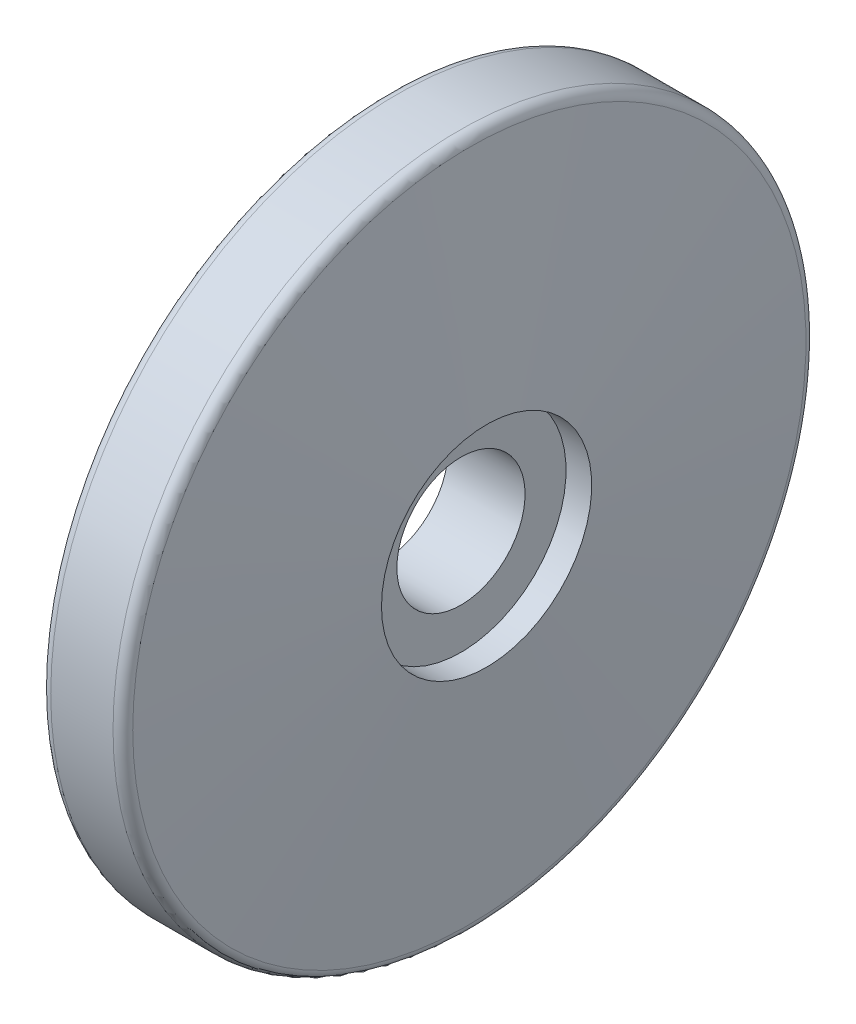
ISO-10303-21;
HEADER;
FILE_DESCRIPTION(('STEP AP214'),'2;1');
FILE_NAME('part.step','',(''),(''),'','','');
FILE_SCHEMA(('AUTOMOTIVE_DESIGN { 1 0 10303 214 1 1 1 1 }'));
ENDSEC;
DATA;
#1=APPLICATION_CONTEXT('core data for automotive mechanical design processes');
#2=APPLICATION_PROTOCOL_DEFINITION('international standard','automotive_design',2000,#1);
#3=PRODUCT_CONTEXT('',#1,'mechanical');
#4=PRODUCT('Part','Part','',(#3));
#5=PRODUCT_RELATED_PRODUCT_CATEGORY('part','',(#4));
#6=PRODUCT_DEFINITION_FORMATION('','',#4);
#7=PRODUCT_DEFINITION_CONTEXT('part definition',#1,'design');
#8=PRODUCT_DEFINITION('design','',#6,#7);
#9=PRODUCT_DEFINITION_SHAPE('','',#8);
#10=(LENGTH_UNIT() NAMED_UNIT(*) SI_UNIT(.MILLI.,.METRE.));
#11=(NAMED_UNIT(*) PLANE_ANGLE_UNIT() SI_UNIT($,.RADIAN.));
#12=(NAMED_UNIT(*) SI_UNIT($,.STERADIAN.) SOLID_ANGLE_UNIT());
#13=UNCERTAINTY_MEASURE_WITH_UNIT(LENGTH_MEASURE(1.E-05),#10,'distance_accuracy_value','');
#14=(GEOMETRIC_REPRESENTATION_CONTEXT(3) GLOBAL_UNCERTAINTY_ASSIGNED_CONTEXT((#13)) GLOBAL_UNIT_ASSIGNED_CONTEXT((#10,
#11,#12)) REPRESENTATION_CONTEXT('',''));
#15=CARTESIAN_POINT('',(0.,0.,0.));
#16=DIRECTION('',(0.,0.,1.));
#17=DIRECTION('',(1.,0.,0.));
#18=AXIS2_PLACEMENT_3D('',#15,#16,#17);
#19=CARTESIAN_POINT('',(6.42830082929983,20.5,0.));
#20=DIRECTION('',(-1.,0.,0.));
#21=DIRECTION('',(0.,0.,1.));
#22=AXIS2_PLACEMENT_3D('',#19,#20,#21);
#23=PLANE('',#22);
#24=CARTESIAN_POINT('',(6.42830082929979,0.,0.));
#25=DIRECTION('',(-1.,0.,0.));
#26=DIRECTION('',(0.,0.,1.));
#27=AXIS2_PLACEMENT_3D('',#24,#25,#26);
#28=CIRCLE('',#27,20.5);
#29=CARTESIAN_POINT('',(6.42830082929979,0.,20.5));
#30=VERTEX_POINT('',#29);
#31=EDGE_CURVE('E72',#30,#30,#28,.T.);
#32=ORIENTED_EDGE('',*,*,#31,.F.);
#33=EDGE_LOOP('',(#32));
#34=FACE_BOUND('',#33,.T.);
#35=CARTESIAN_POINT('',(6.42830082929979,0.,0.));
#36=DIRECTION('',(-1.,0.,0.));
#37=DIRECTION('',(0.,0.,1.));
#38=AXIS2_PLACEMENT_3D('',#35,#36,#37);
#39=CIRCLE('',#38,12.5);
#40=CARTESIAN_POINT('',(6.42830082929979,0.,12.5));
#41=VERTEX_POINT('',#40);
#42=EDGE_CURVE('E10',#41,#41,#39,.T.);
#43=ORIENTED_EDGE('',*,*,#42,.T.);
#44=EDGE_LOOP('',(#43));
#45=FACE_BOUND('',#44,.T.);
#46=ADVANCED_FACE('F32',(#34,#45),#23,.F.);
#47=CARTESIAN_POINT('',(-643.332684127967,0.,0.));
#48=DIRECTION('',(-1.,0.,0.));
#49=DIRECTION('',(0.,0.,1.));
#50=AXIS2_PLACEMENT_3D('',#47,#48,#49);
#51=CYLINDRICAL_SURFACE('',#50,12.5);
#52=ORIENTED_EDGE('',*,*,#42,.F.);
#53=EDGE_LOOP('',(#52));
#54=FACE_BOUND('',#53,.T.);
#55=CARTESIAN_POINT('',(-8.57169917070022,0.,0.));
#56=DIRECTION('',(-1.,0.,0.));
#57=DIRECTION('',(0.,0.,1.));
#58=AXIS2_PLACEMENT_3D('',#55,#56,#57);
#59=CIRCLE('',#58,12.5);
#60=CARTESIAN_POINT('',(-8.57169917070022,0.,12.5));
#61=VERTEX_POINT('',#60);
#62=EDGE_CURVE('E38',#61,#61,#59,.T.);
#63=ORIENTED_EDGE('',*,*,#62,.T.);
#64=EDGE_LOOP('',(#63));
#65=FACE_BOUND('',#64,.T.);
#66=ADVANCED_FACE('F79',(#54,#65),#51,.F.);
#67=CARTESIAN_POINT('',(-8.57169917070017,12.5,0.));
#68=DIRECTION('',(1.,0.,0.));
#69=DIRECTION('',(0.,0.,-1.));
#70=AXIS2_PLACEMENT_3D('',#67,#68,#69);
#71=PLANE('',#70);
#72=ORIENTED_EDGE('',*,*,#62,.F.);
#73=EDGE_LOOP('',(#72));
#74=FACE_BOUND('',#73,.T.);
#75=CARTESIAN_POINT('',(-8.57169917070022,0.,0.));
#76=DIRECTION('',(-1.,0.,0.));
#77=DIRECTION('',(0.,0.,1.));
#78=AXIS2_PLACEMENT_3D('',#75,#76,#77);
#79=CIRCLE('',#78,26.);
#80=CARTESIAN_POINT('',(-8.57169917070022,0.,26.));
#81=VERTEX_POINT('',#80);
#82=EDGE_CURVE('E42',#81,#81,#79,.T.);
#83=ORIENTED_EDGE('',*,*,#82,.T.);
#84=EDGE_LOOP('',(#83));
#85=FACE_BOUND('',#84,.T.);
#86=ADVANCED_FACE('F83',(#74,#85),#71,.F.);
#87=CARTESIAN_POINT('',(-643.332684127967,0.,0.));
#88=DIRECTION('',(-1.,0.,0.));
#89=DIRECTION('',(0.,0.,1.));
#90=AXIS2_PLACEMENT_3D('',#87,#88,#89);
#91=CYLINDRICAL_SURFACE('',#90,26.);
#92=ORIENTED_EDGE('',*,*,#82,.F.);
#93=EDGE_LOOP('',(#92));
#94=FACE_BOUND('',#93,.T.);
#95=CARTESIAN_POINT('',(-13.0716991707002,0.,0.));
#96=DIRECTION('',(-1.,0.,0.));
#97=DIRECTION('',(0.,0.,1.));
#98=AXIS2_PLACEMENT_3D('',#95,#96,#97);
#99=CIRCLE('',#98,26.);
#100=CARTESIAN_POINT('',(-13.0716991707002,0.,26.));
#101=VERTEX_POINT('',#100);
#102=EDGE_CURVE('E46',#101,#101,#99,.T.);
#103=ORIENTED_EDGE('',*,*,#102,.T.);
#104=EDGE_LOOP('',(#103));
#105=FACE_BOUND('',#104,.T.);
#106=ADVANCED_FACE('F88',(#94,#105),#91,.F.);
#107=CARTESIAN_POINT('',(-13.0716991707002,26.,0.));
#108=DIRECTION('',(1.,0.,0.));
#109=DIRECTION('',(0.,0.,-1.));
#110=AXIS2_PLACEMENT_3D('',#107,#108,#109);
#111=PLANE('',#110);
#112=ORIENTED_EDGE('',*,*,#102,.F.);
#113=EDGE_LOOP('',(#112));
#114=FACE_BOUND('',#113,.T.);
#115=CARTESIAN_POINT('',(-13.0716991707002,0.,0.));
#116=DIRECTION('',(-1.,0.,0.));
#117=DIRECTION('',(0.,0.,1.));
#118=AXIS2_PLACEMENT_3D('',#115,#116,#117);
#119=CIRCLE('',#118,30.);
#120=CARTESIAN_POINT('',(-13.0716991707002,0.,30.));
#121=VERTEX_POINT('',#120);
#122=EDGE_CURVE('E51',#121,#121,#119,.T.);
#123=ORIENTED_EDGE('',*,*,#122,.T.);
#124=EDGE_LOOP('',(#123));
#125=FACE_BOUND('',#124,.T.);
#126=ADVANCED_FACE('F94',(#114,#125),#111,.F.);
#127=CARTESIAN_POINT('',(-643.332684127967,0.,0.));
#128=DIRECTION('',(-1.,0.,0.));
#129=DIRECTION('',(0.,0.,1.));
#130=AXIS2_PLACEMENT_3D('',#127,#128,#129);
#131=CYLINDRICAL_SURFACE('',#130,30.);
#132=ORIENTED_EDGE('',*,*,#122,.F.);
#133=EDGE_LOOP('',(#132));
#134=FACE_BOUND('',#133,.T.);
#135=CARTESIAN_POINT('',(-8.07169917070016,0.,0.));
#136=DIRECTION('',(-1.,0.,0.));
#137=DIRECTION('',(0.,0.,1.));
#138=AXIS2_PLACEMENT_3D('',#135,#136,#137);
#139=CIRCLE('',#138,30.);
#140=CARTESIAN_POINT('',(-8.07169917070016,0.,30.));
#141=VERTEX_POINT('',#140);
#142=EDGE_CURVE('E54',#141,#141,#139,.T.);
#143=ORIENTED_EDGE('',*,*,#142,.T.);
#144=EDGE_LOOP('',(#143));
#145=FACE_BOUND('',#144,.T.);
#146=ADVANCED_FACE('F98',(#134,#145),#131,.T.);
#147=CARTESIAN_POINT('',(-8.07169917070017,30.,0.));
#148=DIRECTION('',(1.,0.,0.));
#149=DIRECTION('',(0.,0.,-1.));
#150=AXIS2_PLACEMENT_3D('',#147,#148,#149);
#151=PLANE('',#150);
#152=ORIENTED_EDGE('',*,*,#142,.F.);
#153=EDGE_LOOP('',(#152));
#154=FACE_BOUND('',#153,.T.);
#155=CARTESIAN_POINT('',(-8.07169917070016,0.,0.));
#156=DIRECTION('',(-1.,0.,0.));
#157=DIRECTION('',(0.,0.,1.));
#158=AXIS2_PLACEMENT_3D('',#155,#156,#157);
#159=CIRCLE('',#158,65.5);
#160=CARTESIAN_POINT('',(-8.07169917070016,0.,65.5));
#161=VERTEX_POINT('',#160);
#162=EDGE_CURVE('E57',#161,#161,#159,.T.);
#163=ORIENTED_EDGE('',*,*,#162,.T.);
#164=EDGE_LOOP('',(#163));
#165=FACE_BOUND('',#164,.T.);
#166=ADVANCED_FACE('F102',(#154,#165),#151,.F.);
#167=CARTESIAN_POINT('',(-6.07169917070017,0.,0.));
#168=DIRECTION('',(-1.,0.,0.));
#169=DIRECTION('',(0.,0.,1.));
#170=AXIS2_PLACEMENT_3D('',#167,#168,#169);
#171=TOROIDAL_SURFACE('',#170,65.5,2.);
#172=ORIENTED_EDGE('',*,*,#162,.F.);
#173=EDGE_LOOP('',(#172));
#174=FACE_BOUND('',#173,.T.);
#175=CARTESIAN_POINT('',(-6.07169917070016,0.,0.));
#176=DIRECTION('',(-1.,0.,0.));
#177=DIRECTION('',(0.,0.,1.));
#178=AXIS2_PLACEMENT_3D('',#175,#176,#177);
#179=CIRCLE('',#178,67.5);
#180=CARTESIAN_POINT('',(-6.07169917070016,0.,67.5));
#181=VERTEX_POINT('',#180);
#182=EDGE_CURVE('E60',#181,#181,#179,.T.);
#183=ORIENTED_EDGE('',*,*,#182,.T.);
#184=EDGE_LOOP('',(#183));
#185=FACE_BOUND('',#184,.T.);
#186=ADVANCED_FACE('F106',(#174,#185),#171,.T.);
#187=CARTESIAN_POINT('',(-643.332684127967,0.,0.));
#188=DIRECTION('',(-1.,0.,0.));
#189=DIRECTION('',(0.,0.,1.));
#190=AXIS2_PLACEMENT_3D('',#187,#188,#189);
#191=CYLINDRICAL_SURFACE('',#190,67.5);
#192=ORIENTED_EDGE('',*,*,#182,.F.);
#193=EDGE_LOOP('',(#192));
#194=FACE_BOUND('',#193,.T.);
#195=CARTESIAN_POINT('',(6.07169917070016,0.,0.));
#196=DIRECTION('',(-1.,0.,0.));
#197=DIRECTION('',(0.,0.,1.));
#198=AXIS2_PLACEMENT_3D('',#195,#196,#197);
#199=CIRCLE('',#198,67.5);
#200=CARTESIAN_POINT('',(6.07169917070016,0.,67.5));
#201=VERTEX_POINT('',#200);
#202=EDGE_CURVE('E63',#201,#201,#199,.T.);
#203=ORIENTED_EDGE('',*,*,#202,.T.);
#204=EDGE_LOOP('',(#203));
#205=FACE_BOUND('',#204,.T.);
#206=ADVANCED_FACE('F110',(#194,#205),#191,.T.);
#207=CARTESIAN_POINT('',(6.07169917070017,0.,0.));
#208=DIRECTION('',(-1.,0.,0.));
#209=DIRECTION('',(0.,0.,1.));
#210=AXIS2_PLACEMENT_3D('',#207,#208,#209);
#211=TOROIDAL_SURFACE('',#210,65.5,2.);
#212=ORIENTED_EDGE('',*,*,#202,.F.);
#213=EDGE_LOOP('',(#212));
#214=FACE_BOUND('',#213,.T.);
#215=CARTESIAN_POINT('',(8.0661766333211,0.,0.));
#216=DIRECTION('',(-1.,0.,0.));
#217=DIRECTION('',(0.,0.,1.));
#218=AXIS2_PLACEMENT_3D('',#215,#216,#217);
#219=CIRCLE('',#218,65.6485249174292);
#220=CARTESIAN_POINT('',(8.0661766333211,0.,65.6485249174292));
#221=VERTEX_POINT('',#220);
#222=EDGE_CURVE('E66',#221,#221,#219,.T.);
#223=ORIENTED_EDGE('',*,*,#222,.T.);
#224=EDGE_LOOP('',(#223));
#225=FACE_BOUND('',#224,.T.);
#226=ADVANCED_FACE('F114',(#214,#225),#211,.T.);
#227=CARTESIAN_POINT('',(11.4283008292998,0.,0.));
#228=DIRECTION('',(-1.,0.,0.));
#229=DIRECTION('',(0.,0.,1.));
#230=AXIS2_PLACEMENT_3D('',#227,#228,#229);
#231=CONICAL_SURFACE('',#230,20.5,1.49646543962723);
#232=ORIENTED_EDGE('',*,*,#222,.F.);
#233=EDGE_LOOP('',(#232));
#234=FACE_BOUND('',#233,.T.);
#235=CARTESIAN_POINT('',(11.4283008292998,0.,0.));
#236=DIRECTION('',(-1.,0.,0.));
#237=DIRECTION('',(0.,0.,1.));
#238=AXIS2_PLACEMENT_3D('',#235,#236,#237);
#239=CIRCLE('',#238,20.5);
#240=CARTESIAN_POINT('',(11.4283008292998,0.,20.5));
#241=VERTEX_POINT('',#240);
#242=EDGE_CURVE('E69',#241,#241,#239,.T.);
#243=ORIENTED_EDGE('',*,*,#242,.T.);
#244=EDGE_LOOP('',(#243));
#245=FACE_BOUND('',#244,.T.);
#246=ADVANCED_FACE('F118',(#234,#245),#231,.T.);
#247=CARTESIAN_POINT('',(-643.332684127967,0.,0.));
#248=DIRECTION('',(-1.,0.,0.));
#249=DIRECTION('',(0.,0.,1.));
#250=AXIS2_PLACEMENT_3D('',#247,#248,#249);
#251=CYLINDRICAL_SURFACE('',#250,20.5);
#252=ORIENTED_EDGE('',*,*,#242,.F.);
#253=EDGE_LOOP('',(#252));
#254=FACE_BOUND('',#253,.T.);
#255=ORIENTED_EDGE('',*,*,#31,.T.);
#256=EDGE_LOOP('',(#255));
#257=FACE_BOUND('',#256,.T.);
#258=ADVANCED_FACE('F76',(#254,#257),#251,.F.);
#259=CLOSED_SHELL('',(#46,#66,#86,#106,#126,#146,#166,#186,#206,#226,#246,#258));
#260=MANIFOLD_SOLID_BREP('B2',#259);
#261=ADVANCED_BREP_SHAPE_REPRESENTATION('',(#18,#260),#14);
#262=SHAPE_DEFINITION_REPRESENTATION(#9,#261);
ENDSEC;
END-ISO-10303-21;
